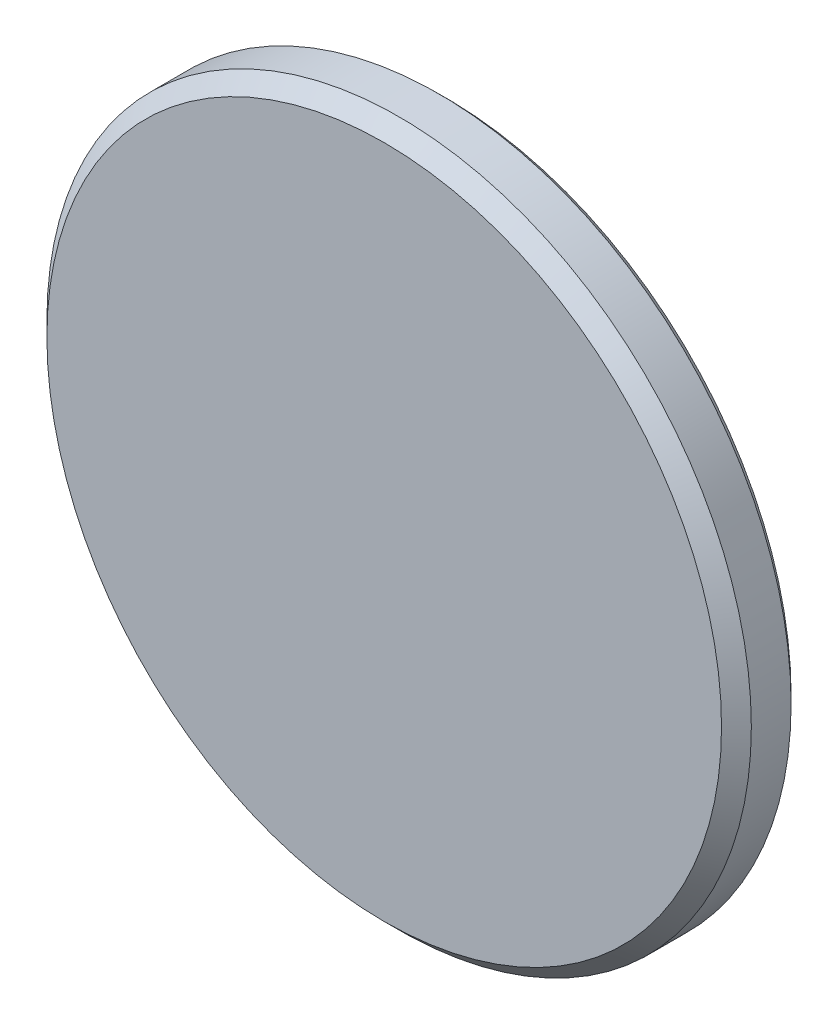
ISO-10303-21;
HEADER;
FILE_DESCRIPTION(('STEP AP214'),'2;1');
FILE_NAME('part.step','',(''),(''),'','','');
FILE_SCHEMA(('AUTOMOTIVE_DESIGN { 1 0 10303 214 1 1 1 1 }'));
ENDSEC;
DATA;
#1=APPLICATION_CONTEXT('core data for automotive mechanical design processes');
#2=APPLICATION_PROTOCOL_DEFINITION('international standard','automotive_design',2000,#1);
#3=PRODUCT_CONTEXT('',#1,'mechanical');
#4=PRODUCT('Part','Part','',(#3));
#5=PRODUCT_RELATED_PRODUCT_CATEGORY('part','',(#4));
#6=PRODUCT_DEFINITION_FORMATION('','',#4);
#7=PRODUCT_DEFINITION_CONTEXT('part definition',#1,'design');
#8=PRODUCT_DEFINITION('design','',#6,#7);
#9=PRODUCT_DEFINITION_SHAPE('','',#8);
#10=(LENGTH_UNIT() NAMED_UNIT(*) SI_UNIT(.MILLI.,.METRE.));
#11=(NAMED_UNIT(*) PLANE_ANGLE_UNIT() SI_UNIT($,.RADIAN.));
#12=(NAMED_UNIT(*) SI_UNIT($,.STERADIAN.) SOLID_ANGLE_UNIT());
#13=UNCERTAINTY_MEASURE_WITH_UNIT(LENGTH_MEASURE(1.E-05),#10,'distance_accuracy_value','');
#14=(GEOMETRIC_REPRESENTATION_CONTEXT(3) GLOBAL_UNCERTAINTY_ASSIGNED_CONTEXT((#13)) GLOBAL_UNIT_ASSIGNED_CONTEXT((#10,
#11,#12)) REPRESENTATION_CONTEXT('',''));
#15=CARTESIAN_POINT('',(0.,0.,0.));
#16=DIRECTION('',(0.,0.,1.));
#17=DIRECTION('',(1.,0.,0.));
#18=AXIS2_PLACEMENT_3D('',#15,#16,#17);
#19=CARTESIAN_POINT('',(0.,0.,6.35));
#20=DIRECTION('',(0.,0.,1.));
#21=DIRECTION('',(1.,0.,0.));
#22=AXIS2_PLACEMENT_3D('',#19,#20,#21);
#23=PLANE('',#22);
#24=CARTESIAN_POINT('',(0.,0.,6.35));
#25=DIRECTION('',(0.,0.,-1.));
#26=DIRECTION('',(-1.,0.,0.));
#27=AXIS2_PLACEMENT_3D('',#24,#25,#26);
#28=CIRCLE('',#27,34.4805);
#29=CARTESIAN_POINT('',(-34.4805,0.,6.35));
#30=VERTEX_POINT('',#29);
#31=EDGE_CURVE('E17',#30,#30,#28,.T.);
#32=ORIENTED_EDGE('',*,*,#31,.F.);
#33=EDGE_LOOP('',(#32));
#34=FACE_BOUND('',#33,.T.);
#35=ADVANCED_FACE('F14',(#34),#23,.T.);
#36=CARTESIAN_POINT('',(0.,0.,4.82599999999999));
#37=DIRECTION('',(0.,0.,-1.));
#38=DIRECTION('',(-1.,0.,0.));
#39=AXIS2_PLACEMENT_3D('',#36,#37,#38);
#40=CONICAL_SURFACE('',#39,36.0045,0.785398163397448);
#41=ORIENTED_EDGE('',*,*,#31,.T.);
#42=EDGE_LOOP('',(#41));
#43=FACE_BOUND('',#42,.T.);
#44=CARTESIAN_POINT('',(0.,0.,4.82599999999998));
#45=DIRECTION('',(0.,0.,-1.));
#46=DIRECTION('',(-1.,0.,0.));
#47=AXIS2_PLACEMENT_3D('',#44,#45,#46);
#48=CIRCLE('',#47,36.0045);
#49=CARTESIAN_POINT('',(-36.0045,0.,4.82599999999998));
#50=VERTEX_POINT('',#49);
#51=EDGE_CURVE('E25',#50,#50,#48,.T.);
#52=ORIENTED_EDGE('',*,*,#51,.F.);
#53=EDGE_LOOP('',(#52));
#54=FACE_BOUND('',#53,.T.);
#55=ADVANCED_FACE('F34',(#43,#54),#40,.T.);
#56=CARTESIAN_POINT('',(0.,0.,6.35));
#57=DIRECTION('',(0.,0.,-1.));
#58=DIRECTION('',(-1.,0.,0.));
#59=AXIS2_PLACEMENT_3D('',#56,#57,#58);
#60=CYLINDRICAL_SURFACE('',#59,36.0045);
#61=ORIENTED_EDGE('',*,*,#51,.T.);
#62=EDGE_LOOP('',(#61));
#63=FACE_BOUND('',#62,.T.);
#64=CARTESIAN_POINT('',(0.,0.,0.761999999999985));
#65=DIRECTION('',(0.,0.,1.));
#66=DIRECTION('',(1.,0.,0.));
#67=AXIS2_PLACEMENT_3D('',#64,#65,#66);
#68=CIRCLE('',#67,36.0045);
#69=CARTESIAN_POINT('',(36.0045,0.,0.761999999999983));
#70=VERTEX_POINT('',#69);
#71=EDGE_CURVE('E21',#70,#70,#68,.F.);
#72=ORIENTED_EDGE('',*,*,#71,.F.);
#73=EDGE_LOOP('',(#72));
#74=FACE_BOUND('',#73,.T.);
#75=ADVANCED_FACE('F42',(#63,#74),#60,.T.);
#76=CARTESIAN_POINT('',(0.,0.,0.761999999999985));
#77=DIRECTION('',(0.,0.,1.));
#78=DIRECTION('',(1.,0.,0.));
#79=AXIS2_PLACEMENT_3D('',#76,#77,#78);
#80=CONICAL_SURFACE('',#79,36.0045,0.785398163397448);
#81=CARTESIAN_POINT('',(0.,0.,0.));
#82=DIRECTION('',(0.,0.,1.));
#83=DIRECTION('',(1.,0.,0.));
#84=AXIS2_PLACEMENT_3D('',#81,#82,#83);
#85=CIRCLE('',#84,35.2425);
#86=CARTESIAN_POINT('',(35.2425,0.,0.));
#87=VERTEX_POINT('',#86);
#88=EDGE_CURVE('E10',#87,#87,#85,.T.);
#89=ORIENTED_EDGE('',*,*,#88,.T.);
#90=EDGE_LOOP('',(#89));
#91=FACE_BOUND('',#90,.T.);
#92=ORIENTED_EDGE('',*,*,#71,.T.);
#93=EDGE_LOOP('',(#92));
#94=FACE_BOUND('',#93,.T.);
#95=ADVANCED_FACE('F45',(#91,#94),#80,.T.);
#96=CARTESIAN_POINT('',(0.,0.,0.));
#97=DIRECTION('',(0.,0.,1.));
#98=DIRECTION('',(1.,0.,0.));
#99=AXIS2_PLACEMENT_3D('',#96,#97,#98);
#100=PLANE('',#99);
#101=ORIENTED_EDGE('',*,*,#88,.F.);
#102=EDGE_LOOP('',(#101));
#103=FACE_BOUND('',#102,.T.);
#104=ADVANCED_FACE('F43',(#103),#100,.F.);
#105=CLOSED_SHELL('',(#35,#55,#75,#95,#104));
#106=MANIFOLD_SOLID_BREP('B1',#105);
#107=ADVANCED_BREP_SHAPE_REPRESENTATION('',(#18,#106),#14);
#108=SHAPE_DEFINITION_REPRESENTATION(#9,#107);
ENDSEC;
END-ISO-10303-21;
